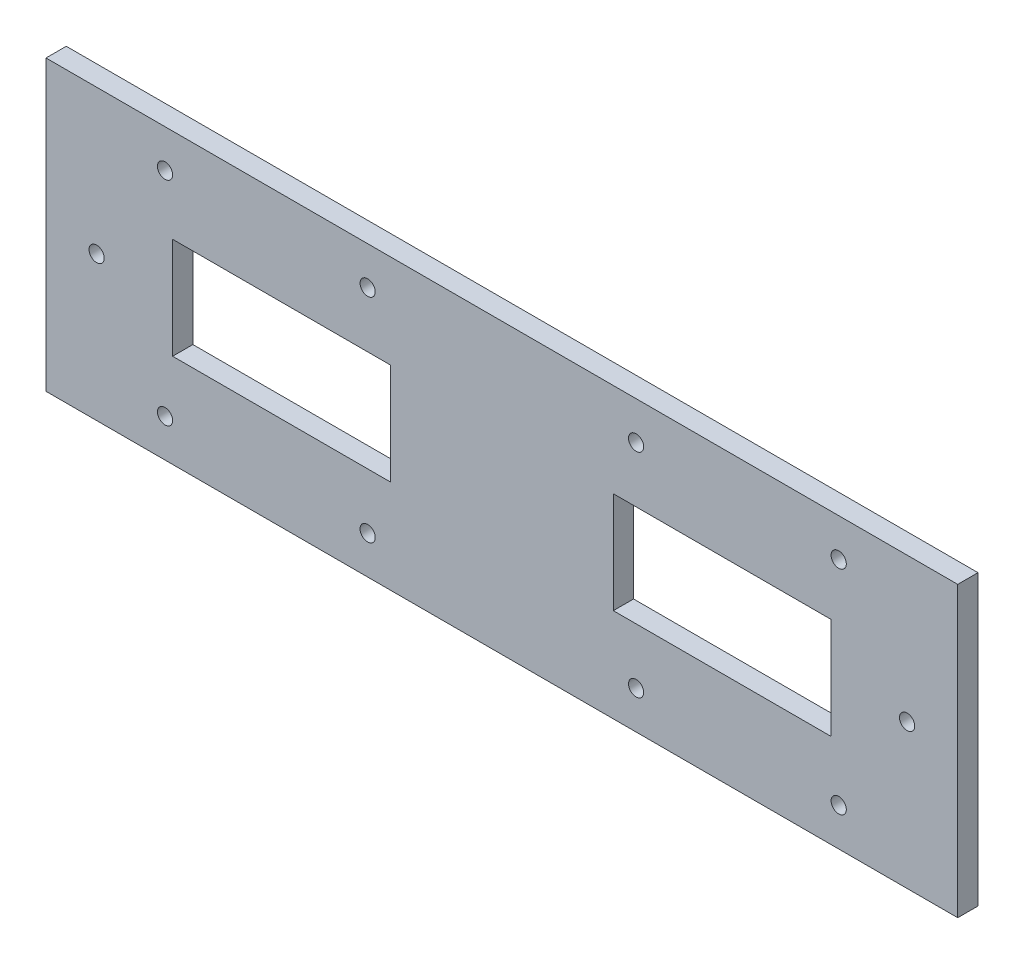
ISO-10303-21;
HEADER;
FILE_DESCRIPTION(('STEP AP214'),'2;1');
FILE_NAME('part.step','',(''),(''),'','','');
FILE_SCHEMA(('AUTOMOTIVE_DESIGN { 1 0 10303 214 1 1 1 1 }'));
ENDSEC;
DATA;
#1=APPLICATION_CONTEXT('core data for automotive mechanical design processes');
#2=APPLICATION_PROTOCOL_DEFINITION('international standard','automotive_design',2000,#1);
#3=PRODUCT_CONTEXT('',#1,'mechanical');
#4=PRODUCT('Part','Part','',(#3));
#5=PRODUCT_RELATED_PRODUCT_CATEGORY('part','',(#4));
#6=PRODUCT_DEFINITION_FORMATION('','',#4);
#7=PRODUCT_DEFINITION_CONTEXT('part definition',#1,'design');
#8=PRODUCT_DEFINITION('design','',#6,#7);
#9=PRODUCT_DEFINITION_SHAPE('','',#8);
#10=(LENGTH_UNIT() NAMED_UNIT(*) SI_UNIT(.MILLI.,.METRE.));
#11=(NAMED_UNIT(*) PLANE_ANGLE_UNIT() SI_UNIT($,.RADIAN.));
#12=(NAMED_UNIT(*) SI_UNIT($,.STERADIAN.) SOLID_ANGLE_UNIT());
#13=UNCERTAINTY_MEASURE_WITH_UNIT(LENGTH_MEASURE(1.E-05),#10,'distance_accuracy_value','');
#14=(GEOMETRIC_REPRESENTATION_CONTEXT(3) GLOBAL_UNCERTAINTY_ASSIGNED_CONTEXT((#13)) GLOBAL_UNIT_ASSIGNED_CONTEXT((#10,
#11,#12)) REPRESENTATION_CONTEXT('',''));
#15=CARTESIAN_POINT('',(0.,0.,0.));
#16=DIRECTION('',(0.,0.,1.));
#17=DIRECTION('',(1.,0.,0.));
#18=AXIS2_PLACEMENT_3D('',#15,#16,#17);
#19=CARTESIAN_POINT('',(0.,7.2232845894263,-4.));
#20=DIRECTION('',(0.,-1.,0.));
#21=DIRECTION('',(0.,0.,-1.));
#22=AXIS2_PLACEMENT_3D('',#19,#20,#21);
#23=PLANE('',#22);
#24=DIRECTION('',(1.,0.,0.));
#25=VECTOR('',#24,1.);
#26=CARTESIAN_POINT('',(0.,7.2232845894263,0.));
#27=LINE('',#26,#25);
#28=CARTESIAN_POINT('',(-46.5564090804862,7.2232845894263,0.));
#29=VERTEX_POINT('',#28);
#30=CARTESIAN_POINT('',(-3.55640908048613,7.2232845894263,0.));
#31=VERTEX_POINT('',#30);
#32=EDGE_CURVE('E210',#29,#31,#27,.T.);
#33=ORIENTED_EDGE('',*,*,#32,.F.);
#34=DIRECTION('',(0.,0.,1.));
#35=VECTOR('',#34,1.);
#36=CARTESIAN_POINT('',(-46.5564090804862,7.2232845894263,-4.));
#37=LINE('',#36,#35);
#38=CARTESIAN_POINT('',(-46.5564090804862,7.2232845894263,-4.));
#39=VERTEX_POINT('',#38);
#40=EDGE_CURVE('E11',#39,#29,#37,.T.);
#41=ORIENTED_EDGE('',*,*,#40,.F.);
#42=DIRECTION('',(1.,0.,0.));
#43=VECTOR('',#42,1.);
#44=CARTESIAN_POINT('',(0.,7.2232845894263,-4.));
#45=LINE('',#44,#43);
#46=CARTESIAN_POINT('',(-3.55640908048613,7.2232845894263,-4.));
#47=VERTEX_POINT('',#46);
#48=EDGE_CURVE('E150',#39,#47,#45,.T.);
#49=ORIENTED_EDGE('',*,*,#48,.T.);
#50=DIRECTION('',(0.,0.,1.));
#51=VECTOR('',#50,1.);
#52=CARTESIAN_POINT('',(-3.55640908048613,7.2232845894263,-4.));
#53=LINE('',#52,#51);
#54=EDGE_CURVE('E147',#47,#31,#53,.T.);
#55=ORIENTED_EDGE('',*,*,#54,.T.);
#56=EDGE_LOOP('',(#33,#41,#49,#55));
#57=FACE_BOUND('',#56,.T.);
#58=ADVANCED_FACE('F35',(#57),#23,.T.);
#59=CARTESIAN_POINT('',(-46.5564090804862,0.,-4.));
#60=DIRECTION('',(-1.,0.,0.));
#61=DIRECTION('',(0.,0.,1.));
#62=AXIS2_PLACEMENT_3D('',#59,#60,#61);
#63=PLANE('',#62);
#64=DIRECTION('',(0.,-1.,0.));
#65=VECTOR('',#64,1.);
#66=CARTESIAN_POINT('',(-46.5564090804862,0.,0.));
#67=LINE('',#66,#65);
#68=CARTESIAN_POINT('',(-46.5564090804862,-12.7767154105737,0.));
#69=VERTEX_POINT('',#68);
#70=EDGE_CURVE('E216',#29,#69,#67,.T.);
#71=ORIENTED_EDGE('',*,*,#70,.T.);
#72=DIRECTION('',(0.,0.,1.));
#73=VECTOR('',#72,1.);
#74=CARTESIAN_POINT('',(-46.5564090804862,-12.7767154105737,-4.));
#75=LINE('',#74,#73);
#76=CARTESIAN_POINT('',(-46.5564090804862,-12.7767154105737,-4.));
#77=VERTEX_POINT('',#76);
#78=EDGE_CURVE('E45',#77,#69,#75,.T.);
#79=ORIENTED_EDGE('',*,*,#78,.F.);
#80=DIRECTION('',(0.,-1.,0.));
#81=VECTOR('',#80,1.);
#82=CARTESIAN_POINT('',(-46.5564090804862,0.,-4.));
#83=LINE('',#82,#81);
#84=EDGE_CURVE('E139',#39,#77,#83,.T.);
#85=ORIENTED_EDGE('',*,*,#84,.F.);
#86=ORIENTED_EDGE('',*,*,#40,.T.);
#87=EDGE_LOOP('',(#71,#79,#85,#86));
#88=FACE_BOUND('',#87,.T.);
#89=ADVANCED_FACE('F264',(#88),#63,.F.);
#90=CARTESIAN_POINT('',(0.,-12.7767154105737,-4.));
#91=DIRECTION('',(0.,-1.,0.));
#92=DIRECTION('',(1.,0.,0.));
#93=AXIS2_PLACEMENT_3D('',#90,#91,#92);
#94=PLANE('',#93);
#95=DIRECTION('',(1.,0.,0.));
#96=VECTOR('',#95,1.);
#97=CARTESIAN_POINT('',(0.,-12.7767154105737,0.));
#98=LINE('',#97,#96);
#99=CARTESIAN_POINT('',(-3.55640908048612,-12.7767154105737,0.));
#100=VERTEX_POINT('',#99);
#101=EDGE_CURVE('E94',#69,#100,#98,.T.);
#102=ORIENTED_EDGE('',*,*,#101,.T.);
#103=DIRECTION('',(0.,0.,1.));
#104=VECTOR('',#103,1.);
#105=CARTESIAN_POINT('',(-3.55640908048612,-12.7767154105737,-4.));
#106=LINE('',#105,#104);
#107=CARTESIAN_POINT('',(-3.55640908048612,-12.7767154105737,-4.));
#108=VERTEX_POINT('',#107);
#109=EDGE_CURVE('E143',#108,#100,#106,.T.);
#110=ORIENTED_EDGE('',*,*,#109,.F.);
#111=DIRECTION('',(1.,0.,0.));
#112=VECTOR('',#111,1.);
#113=CARTESIAN_POINT('',(0.,-12.7767154105737,-4.));
#114=LINE('',#113,#112);
#115=EDGE_CURVE('E133',#77,#108,#114,.T.);
#116=ORIENTED_EDGE('',*,*,#115,.F.);
#117=ORIENTED_EDGE('',*,*,#78,.T.);
#118=EDGE_LOOP('',(#102,#110,#116,#117));
#119=FACE_BOUND('',#118,.T.);
#120=ADVANCED_FACE('F144',(#119),#94,.F.);
#121=CARTESIAN_POINT('',(108.443590919514,0.,-4.));
#122=DIRECTION('',(-1.,0.,0.));
#123=DIRECTION('',(0.,-1.,0.));
#124=AXIS2_PLACEMENT_3D('',#121,#122,#123);
#125=PLANE('',#124);
#126=DIRECTION('',(0.,-1.,0.));
#127=VECTOR('',#126,1.);
#128=CARTESIAN_POINT('',(108.443590919514,0.,0.));
#129=LINE('',#128,#127);
#130=CARTESIAN_POINT('',(108.443590919514,25.7232845894263,0.));
#131=VERTEX_POINT('',#130);
#132=CARTESIAN_POINT('',(108.443590919514,-31.2767154105737,0.));
#133=VERTEX_POINT('',#132);
#134=EDGE_CURVE('E199',#131,#133,#129,.T.);
#135=ORIENTED_EDGE('',*,*,#134,.T.);
#136=DIRECTION('',(0.,0.,1.));
#137=VECTOR('',#136,1.);
#138=CARTESIAN_POINT('',(108.443590919514,-31.2767154105737,-4.));
#139=LINE('',#138,#137);
#140=CARTESIAN_POINT('',(108.443590919514,-31.2767154105737,-4.));
#141=VERTEX_POINT('',#140);
#142=EDGE_CURVE('E221',#141,#133,#139,.T.);
#143=ORIENTED_EDGE('',*,*,#142,.F.);
#144=DIRECTION('',(0.,-1.,0.));
#145=VECTOR('',#144,1.);
#146=CARTESIAN_POINT('',(108.443590919514,0.,-4.));
#147=LINE('',#146,#145);
#148=CARTESIAN_POINT('',(108.443590919514,25.7232845894263,-4.));
#149=VERTEX_POINT('',#148);
#150=EDGE_CURVE('E298',#149,#141,#147,.T.);
#151=ORIENTED_EDGE('',*,*,#150,.F.);
#152=DIRECTION('',(0.,0.,1.));
#153=VECTOR('',#152,1.);
#154=CARTESIAN_POINT('',(108.443590919514,25.7232845894263,-4.));
#155=LINE('',#154,#153);
#156=EDGE_CURVE('E227',#149,#131,#155,.T.);
#157=ORIENTED_EDGE('',*,*,#156,.T.);
#158=EDGE_LOOP('',(#135,#143,#151,#157));
#159=FACE_BOUND('',#158,.T.);
#160=ADVANCED_FACE('F277',(#159),#125,.F.);
#161=CARTESIAN_POINT('',(0.,-31.2767154105737,-4.));
#162=DIRECTION('',(0.,-1.,0.));
#163=DIRECTION('',(1.,0.,0.));
#164=AXIS2_PLACEMENT_3D('',#161,#162,#163);
#165=PLANE('',#164);
#166=DIRECTION('',(1.,0.,0.));
#167=VECTOR('',#166,1.);
#168=CARTESIAN_POINT('',(0.,-31.2767154105737,0.));
#169=LINE('',#168,#167);
#170=CARTESIAN_POINT('',(-71.5564090804862,-31.2767154105737,0.));
#171=VERTEX_POINT('',#170);
#172=EDGE_CURVE('E207',#171,#133,#169,.T.);
#173=ORIENTED_EDGE('',*,*,#172,.F.);
#174=DIRECTION('',(0.,0.,1.));
#175=VECTOR('',#174,1.);
#176=CARTESIAN_POINT('',(-71.5564090804862,-31.2767154105737,-4.));
#177=LINE('',#176,#175);
#178=CARTESIAN_POINT('',(-71.5564090804862,-31.2767154105737,-4.));
#179=VERTEX_POINT('',#178);
#180=EDGE_CURVE('E223',#179,#171,#177,.T.);
#181=ORIENTED_EDGE('',*,*,#180,.F.);
#182=DIRECTION('',(1.,0.,0.));
#183=VECTOR('',#182,1.);
#184=CARTESIAN_POINT('',(0.,-31.2767154105737,-4.));
#185=LINE('',#184,#183);
#186=EDGE_CURVE('E152',#179,#141,#185,.T.);
#187=ORIENTED_EDGE('',*,*,#186,.T.);
#188=ORIENTED_EDGE('',*,*,#142,.T.);
#189=EDGE_LOOP('',(#173,#181,#187,#188));
#190=FACE_BOUND('',#189,.T.);
#191=ADVANCED_FACE('F273',(#190),#165,.T.);
#192=CARTESIAN_POINT('',(-71.5564090804862,0.,-4.));
#193=DIRECTION('',(-1.,0.,0.));
#194=DIRECTION('',(0.,0.,1.));
#195=AXIS2_PLACEMENT_3D('',#192,#193,#194);
#196=PLANE('',#195);
#197=DIRECTION('',(0.,-1.,0.));
#198=VECTOR('',#197,1.);
#199=CARTESIAN_POINT('',(-71.5564090804862,0.,0.));
#200=LINE('',#199,#198);
#201=CARTESIAN_POINT('',(-71.5564090804862,25.7232845894263,0.));
#202=VERTEX_POINT('',#201);
#203=EDGE_CURVE('E204',#202,#171,#200,.T.);
#204=ORIENTED_EDGE('',*,*,#203,.F.);
#205=DIRECTION('',(0.,0.,1.));
#206=VECTOR('',#205,1.);
#207=CARTESIAN_POINT('',(-71.5564090804862,25.7232845894263,-4.));
#208=LINE('',#207,#206);
#209=CARTESIAN_POINT('',(-71.5564090804862,25.7232845894263,-4.));
#210=VERTEX_POINT('',#209);
#211=EDGE_CURVE('E225',#210,#202,#208,.T.);
#212=ORIENTED_EDGE('',*,*,#211,.F.);
#213=DIRECTION('',(0.,-1.,0.));
#214=VECTOR('',#213,1.);
#215=CARTESIAN_POINT('',(-71.5564090804862,0.,-4.));
#216=LINE('',#215,#214);
#217=EDGE_CURVE('E314',#210,#179,#216,.T.);
#218=ORIENTED_EDGE('',*,*,#217,.T.);
#219=ORIENTED_EDGE('',*,*,#180,.T.);
#220=EDGE_LOOP('',(#204,#212,#218,#219));
#221=FACE_BOUND('',#220,.T.);
#222=ADVANCED_FACE('F276',(#221),#196,.T.);
#223=CARTESIAN_POINT('',(40.4435909195139,0.,-4.));
#224=DIRECTION('',(-1.,0.,0.));
#225=DIRECTION('',(0.,0.,1.));
#226=AXIS2_PLACEMENT_3D('',#223,#224,#225);
#227=PLANE('',#226);
#228=DIRECTION('',(0.,-1.,0.));
#229=VECTOR('',#228,1.);
#230=CARTESIAN_POINT('',(40.4435909195139,0.,0.));
#231=LINE('',#230,#229);
#232=CARTESIAN_POINT('',(40.4435909195139,7.2232845894263,0.));
#233=VERTEX_POINT('',#232);
#234=CARTESIAN_POINT('',(40.4435909195139,-12.7767154105737,0.));
#235=VERTEX_POINT('',#234);
#236=EDGE_CURVE('E187',#233,#235,#231,.T.);
#237=ORIENTED_EDGE('',*,*,#236,.T.);
#238=DIRECTION('',(0.,0.,1.));
#239=VECTOR('',#238,1.);
#240=CARTESIAN_POINT('',(40.4435909195139,-12.7767154105737,-4.));
#241=LINE('',#240,#239);
#242=CARTESIAN_POINT('',(40.4435909195139,-12.7767154105737,-4.));
#243=VERTEX_POINT('',#242);
#244=EDGE_CURVE('E230',#243,#235,#241,.T.);
#245=ORIENTED_EDGE('',*,*,#244,.F.);
#246=DIRECTION('',(0.,-1.,0.));
#247=VECTOR('',#246,1.);
#248=CARTESIAN_POINT('',(40.4435909195139,0.,-4.));
#249=LINE('',#248,#247);
#250=CARTESIAN_POINT('',(40.4435909195139,7.2232845894263,-4.));
#251=VERTEX_POINT('',#250);
#252=EDGE_CURVE('E241',#251,#243,#249,.T.);
#253=ORIENTED_EDGE('',*,*,#252,.F.);
#254=DIRECTION('',(0.,0.,1.));
#255=VECTOR('',#254,1.);
#256=CARTESIAN_POINT('',(40.4435909195139,7.2232845894263,-4.));
#257=LINE('',#256,#255);
#258=EDGE_CURVE('E39',#251,#233,#257,.T.);
#259=ORIENTED_EDGE('',*,*,#258,.T.);
#260=EDGE_LOOP('',(#237,#245,#253,#259));
#261=FACE_BOUND('',#260,.T.);
#262=ADVANCED_FACE('F238',(#261),#227,.F.);
#263=CARTESIAN_POINT('',(0.,-12.7767154105737,-4.));
#264=DIRECTION('',(0.,-1.,0.));
#265=DIRECTION('',(1.,0.,0.));
#266=AXIS2_PLACEMENT_3D('',#263,#264,#265);
#267=PLANE('',#266);
#268=DIRECTION('',(1.,0.,0.));
#269=VECTOR('',#268,1.);
#270=CARTESIAN_POINT('',(0.,-12.7767154105737,0.));
#271=LINE('',#270,#269);
#272=CARTESIAN_POINT('',(83.4435909195139,-12.7767154105737,0.));
#273=VERTEX_POINT('',#272);
#274=EDGE_CURVE('E196',#235,#273,#271,.T.);
#275=ORIENTED_EDGE('',*,*,#274,.T.);
#276=DIRECTION('',(0.,0.,1.));
#277=VECTOR('',#276,1.);
#278=CARTESIAN_POINT('',(83.4435909195139,-12.7767154105737,-4.));
#279=LINE('',#278,#277);
#280=CARTESIAN_POINT('',(83.4435909195139,-12.7767154105737,-4.));
#281=VERTEX_POINT('',#280);
#282=EDGE_CURVE('E233',#281,#273,#279,.T.);
#283=ORIENTED_EDGE('',*,*,#282,.F.);
#284=DIRECTION('',(1.,0.,0.));
#285=VECTOR('',#284,1.);
#286=CARTESIAN_POINT('',(0.,-12.7767154105737,-4.));
#287=LINE('',#286,#285);
#288=EDGE_CURVE('E296',#243,#281,#287,.T.);
#289=ORIENTED_EDGE('',*,*,#288,.F.);
#290=ORIENTED_EDGE('',*,*,#244,.T.);
#291=EDGE_LOOP('',(#275,#283,#289,#290));
#292=FACE_BOUND('',#291,.T.);
#293=ADVANCED_FACE('F285',(#292),#267,.F.);
#294=CARTESIAN_POINT('',(83.4435909195139,0.,-4.));
#295=DIRECTION('',(-1.,0.,0.));
#296=DIRECTION('',(0.,0.,1.));
#297=AXIS2_PLACEMENT_3D('',#294,#295,#296);
#298=PLANE('',#297);
#299=DIRECTION('',(0.,-1.,0.));
#300=VECTOR('',#299,1.);
#301=CARTESIAN_POINT('',(83.4435909195139,0.,0.));
#302=LINE('',#301,#300);
#303=CARTESIAN_POINT('',(83.4435909195139,7.2232845894263,0.));
#304=VERTEX_POINT('',#303);
#305=EDGE_CURVE('E193',#304,#273,#302,.T.);
#306=ORIENTED_EDGE('',*,*,#305,.F.);
#307=DIRECTION('',(0.,0.,1.));
#308=VECTOR('',#307,1.);
#309=CARTESIAN_POINT('',(83.4435909195139,7.2232845894263,-4.));
#310=LINE('',#309,#308);
#311=CARTESIAN_POINT('',(83.4435909195139,7.2232845894263,-4.));
#312=VERTEX_POINT('',#311);
#313=EDGE_CURVE('E234',#312,#304,#310,.T.);
#314=ORIENTED_EDGE('',*,*,#313,.F.);
#315=DIRECTION('',(0.,-1.,0.));
#316=VECTOR('',#315,1.);
#317=CARTESIAN_POINT('',(83.4435909195139,0.,-4.));
#318=LINE('',#317,#316);
#319=EDGE_CURVE('E295',#312,#281,#318,.T.);
#320=ORIENTED_EDGE('',*,*,#319,.T.);
#321=ORIENTED_EDGE('',*,*,#282,.T.);
#322=EDGE_LOOP('',(#306,#314,#320,#321));
#323=FACE_BOUND('',#322,.T.);
#324=ADVANCED_FACE('F258',(#323),#298,.T.);
#325=CARTESIAN_POINT('',(0.,25.7232845894263,-4.));
#326=DIRECTION('',(0.,-1.,0.));
#327=DIRECTION('',(1.,0.,0.));
#328=AXIS2_PLACEMENT_3D('',#325,#326,#327);
#329=PLANE('',#328);
#330=DIRECTION('',(1.,0.,0.));
#331=VECTOR('',#330,1.);
#332=CARTESIAN_POINT('',(0.,25.7232845894263,0.));
#333=LINE('',#332,#331);
#334=EDGE_CURVE('E202',#202,#131,#333,.T.);
#335=ORIENTED_EDGE('',*,*,#334,.T.);
#336=ORIENTED_EDGE('',*,*,#156,.F.);
#337=DIRECTION('',(1.,0.,0.));
#338=VECTOR('',#337,1.);
#339=CARTESIAN_POINT('',(0.,25.7232845894263,-4.));
#340=LINE('',#339,#338);
#341=EDGE_CURVE('E312',#210,#149,#340,.T.);
#342=ORIENTED_EDGE('',*,*,#341,.F.);
#343=ORIENTED_EDGE('',*,*,#211,.T.);
#344=EDGE_LOOP('',(#335,#336,#342,#343));
#345=FACE_BOUND('',#344,.T.);
#346=ADVANCED_FACE('F249',(#345),#329,.F.);
#347=CARTESIAN_POINT('',(0.,7.2232845894263,-4.));
#348=DIRECTION('',(0.,-1.,0.));
#349=DIRECTION('',(0.,0.,-1.));
#350=AXIS2_PLACEMENT_3D('',#347,#348,#349);
#351=PLANE('',#350);
#352=DIRECTION('',(1.,0.,0.));
#353=VECTOR('',#352,1.);
#354=CARTESIAN_POINT('',(0.,7.2232845894263,0.));
#355=LINE('',#354,#353);
#356=EDGE_CURVE('E190',#233,#304,#355,.T.);
#357=ORIENTED_EDGE('',*,*,#356,.F.);
#358=ORIENTED_EDGE('',*,*,#258,.F.);
#359=DIRECTION('',(1.,0.,0.));
#360=VECTOR('',#359,1.);
#361=CARTESIAN_POINT('',(0.,7.2232845894263,-4.));
#362=LINE('',#361,#360);
#363=EDGE_CURVE('E301',#251,#312,#362,.T.);
#364=ORIENTED_EDGE('',*,*,#363,.T.);
#365=ORIENTED_EDGE('',*,*,#313,.T.);
#366=EDGE_LOOP('',(#357,#358,#364,#365));
#367=FACE_BOUND('',#366,.T.);
#368=ADVANCED_FACE('F246',(#367),#351,.T.);
#369=CARTESIAN_POINT('',(-48.0564090804862,18.2232845894263,-4.));
#370=DIRECTION('',(0.,0.,1.));
#371=DIRECTION('',(1.,0.,0.));
#372=AXIS2_PLACEMENT_3D('',#369,#370,#371);
#373=CYLINDRICAL_SURFACE('',#372,1.5);
#374=CARTESIAN_POINT('',(-48.0564090804862,18.2232845894263,-4.));
#375=DIRECTION('',(0.,0.,1.));
#376=DIRECTION('',(1.,0.,0.));
#377=AXIS2_PLACEMENT_3D('',#374,#375,#376);
#378=CIRCLE('',#377,1.5);
#379=CARTESIAN_POINT('',(-46.5564090804862,18.2232845894263,-4.));
#380=VERTEX_POINT('',#379);
#381=EDGE_CURVE('E302',#380,#380,#378,.T.);
#382=ORIENTED_EDGE('',*,*,#381,.F.);
#383=EDGE_LOOP('',(#382));
#384=FACE_BOUND('',#383,.T.);
#385=CARTESIAN_POINT('',(-48.0564090804862,18.2232845894263,0.));
#386=DIRECTION('',(0.,0.,1.));
#387=DIRECTION('',(1.,0.,0.));
#388=AXIS2_PLACEMENT_3D('',#385,#386,#387);
#389=CIRCLE('',#388,1.5);
#390=CARTESIAN_POINT('',(-46.5564090804862,18.2232845894263,0.));
#391=VERTEX_POINT('',#390);
#392=EDGE_CURVE('E184',#391,#391,#389,.T.);
#393=ORIENTED_EDGE('',*,*,#392,.T.);
#394=EDGE_LOOP('',(#393));
#395=FACE_BOUND('',#394,.T.);
#396=ADVANCED_FACE('F248',(#384,#395),#373,.F.);
#397=CARTESIAN_POINT('',(-8.05640908048616,18.2232845894263,-4.));
#398=DIRECTION('',(0.,0.,1.));
#399=DIRECTION('',(1.,0.,0.));
#400=AXIS2_PLACEMENT_3D('',#397,#398,#399);
#401=CYLINDRICAL_SURFACE('',#400,1.5);
#402=CARTESIAN_POINT('',(-8.05640908048616,18.2232845894263,-4.));
#403=DIRECTION('',(0.,0.,1.));
#404=DIRECTION('',(1.,0.,0.));
#405=AXIS2_PLACEMENT_3D('',#402,#403,#404);
#406=CIRCLE('',#405,1.5);
#407=CARTESIAN_POINT('',(-6.55640908048616,18.2232845894263,-4.));
#408=VERTEX_POINT('',#407);
#409=EDGE_CURVE('E306',#408,#408,#406,.T.);
#410=ORIENTED_EDGE('',*,*,#409,.F.);
#411=EDGE_LOOP('',(#410));
#412=FACE_BOUND('',#411,.T.);
#413=CARTESIAN_POINT('',(-8.05640908048616,18.2232845894263,0.));
#414=DIRECTION('',(0.,0.,1.));
#415=DIRECTION('',(1.,0.,0.));
#416=AXIS2_PLACEMENT_3D('',#413,#414,#415);
#417=CIRCLE('',#416,1.5);
#418=CARTESIAN_POINT('',(-6.55640908048616,18.2232845894263,0.));
#419=VERTEX_POINT('',#418);
#420=EDGE_CURVE('E181',#419,#419,#417,.T.);
#421=ORIENTED_EDGE('',*,*,#420,.T.);
#422=EDGE_LOOP('',(#421));
#423=FACE_BOUND('',#422,.T.);
#424=ADVANCED_FACE('F255',(#412,#423),#401,.F.);
#425=CARTESIAN_POINT('',(44.9435909195138,18.2232845894263,-4.));
#426=DIRECTION('',(0.,0.,1.));
#427=DIRECTION('',(1.,0.,0.));
#428=AXIS2_PLACEMENT_3D('',#425,#426,#427);
#429=CYLINDRICAL_SURFACE('',#428,1.5);
#430=CARTESIAN_POINT('',(44.9435909195138,18.2232845894263,-4.));
#431=DIRECTION('',(0.,0.,1.));
#432=DIRECTION('',(1.,0.,0.));
#433=AXIS2_PLACEMENT_3D('',#430,#431,#432);
#434=CIRCLE('',#433,1.5);
#435=CARTESIAN_POINT('',(46.4435909195138,18.2232845894263,-4.));
#436=VERTEX_POINT('',#435);
#437=EDGE_CURVE('E514',#436,#436,#434,.T.);
#438=ORIENTED_EDGE('',*,*,#437,.F.);
#439=EDGE_LOOP('',(#438));
#440=FACE_BOUND('',#439,.T.);
#441=CARTESIAN_POINT('',(44.9435909195138,18.2232845894263,0.));
#442=DIRECTION('',(0.,0.,1.));
#443=DIRECTION('',(1.,0.,0.));
#444=AXIS2_PLACEMENT_3D('',#441,#442,#443);
#445=CIRCLE('',#444,1.5);
#446=CARTESIAN_POINT('',(46.4435909195138,18.2232845894263,0.));
#447=VERTEX_POINT('',#446);
#448=EDGE_CURVE('E178',#447,#447,#445,.T.);
#449=ORIENTED_EDGE('',*,*,#448,.T.);
#450=EDGE_LOOP('',(#449));
#451=FACE_BOUND('',#450,.T.);
#452=ADVANCED_FACE('F393',(#440,#451),#429,.F.);
#453=CARTESIAN_POINT('',(84.9435909195138,18.2232845894263,-4.));
#454=DIRECTION('',(0.,0.,1.));
#455=DIRECTION('',(1.,0.,0.));
#456=AXIS2_PLACEMENT_3D('',#453,#454,#455);
#457=CYLINDRICAL_SURFACE('',#456,1.50000000000001);
#458=CARTESIAN_POINT('',(84.9435909195138,18.2232845894263,-4.));
#459=DIRECTION('',(0.,0.,1.));
#460=DIRECTION('',(1.,0.,0.));
#461=AXIS2_PLACEMENT_3D('',#458,#459,#460);
#462=CIRCLE('',#461,1.50000000000001);
#463=CARTESIAN_POINT('',(86.4435909195139,18.2232845894263,-4.));
#464=VERTEX_POINT('',#463);
#465=EDGE_CURVE('E511',#464,#464,#462,.T.);
#466=ORIENTED_EDGE('',*,*,#465,.F.);
#467=EDGE_LOOP('',(#466));
#468=FACE_BOUND('',#467,.T.);
#469=CARTESIAN_POINT('',(84.9435909195138,18.2232845894263,0.));
#470=DIRECTION('',(0.,0.,1.));
#471=DIRECTION('',(1.,0.,0.));
#472=AXIS2_PLACEMENT_3D('',#469,#470,#471);
#473=CIRCLE('',#472,1.50000000000001);
#474=CARTESIAN_POINT('',(86.4435909195139,18.2232845894263,0.));
#475=VERTEX_POINT('',#474);
#476=EDGE_CURVE('E175',#475,#475,#473,.T.);
#477=ORIENTED_EDGE('',*,*,#476,.T.);
#478=EDGE_LOOP('',(#477));
#479=FACE_BOUND('',#478,.T.);
#480=ADVANCED_FACE('F403',(#468,#479),#457,.F.);
#481=CARTESIAN_POINT('',(44.9435909195143,-23.7767154105737,-4.));
#482=DIRECTION('',(0.,0.,1.));
#483=DIRECTION('',(1.,0.,0.));
#484=AXIS2_PLACEMENT_3D('',#481,#482,#483);
#485=CYLINDRICAL_SURFACE('',#484,1.5);
#486=CARTESIAN_POINT('',(44.9435909195143,-23.7767154105737,-4.));
#487=DIRECTION('',(0.,0.,1.));
#488=DIRECTION('',(1.,0.,0.));
#489=AXIS2_PLACEMENT_3D('',#486,#487,#488);
#490=CIRCLE('',#489,1.5);
#491=CARTESIAN_POINT('',(46.4435909195143,-23.7767154105737,-4.));
#492=VERTEX_POINT('',#491);
#493=EDGE_CURVE('E508',#492,#492,#490,.T.);
#494=ORIENTED_EDGE('',*,*,#493,.F.);
#495=EDGE_LOOP('',(#494));
#496=FACE_BOUND('',#495,.T.);
#497=CARTESIAN_POINT('',(44.9435909195143,-23.7767154105737,0.));
#498=DIRECTION('',(0.,0.,1.));
#499=DIRECTION('',(1.,0.,0.));
#500=AXIS2_PLACEMENT_3D('',#497,#498,#499);
#501=CIRCLE('',#500,1.5);
#502=CARTESIAN_POINT('',(46.4435909195143,-23.7767154105737,0.));
#503=VERTEX_POINT('',#502);
#504=EDGE_CURVE('E172',#503,#503,#501,.T.);
#505=ORIENTED_EDGE('',*,*,#504,.T.);
#506=EDGE_LOOP('',(#505));
#507=FACE_BOUND('',#506,.T.);
#508=ADVANCED_FACE('F413',(#496,#507),#485,.F.);
#509=CARTESIAN_POINT('',(84.9435909195143,-23.7767154105737,-4.));
#510=DIRECTION('',(0.,0.,1.));
#511=DIRECTION('',(1.,0.,0.));
#512=AXIS2_PLACEMENT_3D('',#509,#510,#511);
#513=CYLINDRICAL_SURFACE('',#512,1.50000000000001);
#514=CARTESIAN_POINT('',(84.9435909195143,-23.7767154105737,-4.));
#515=DIRECTION('',(0.,0.,1.));
#516=DIRECTION('',(1.,0.,0.));
#517=AXIS2_PLACEMENT_3D('',#514,#515,#516);
#518=CIRCLE('',#517,1.50000000000001);
#519=CARTESIAN_POINT('',(86.4435909195143,-23.7767154105737,-4.));
#520=VERTEX_POINT('',#519);
#521=EDGE_CURVE('E505',#520,#520,#518,.T.);
#522=ORIENTED_EDGE('',*,*,#521,.F.);
#523=EDGE_LOOP('',(#522));
#524=FACE_BOUND('',#523,.T.);
#525=CARTESIAN_POINT('',(84.9435909195143,-23.7767154105737,0.));
#526=DIRECTION('',(0.,0.,1.));
#527=DIRECTION('',(1.,0.,0.));
#528=AXIS2_PLACEMENT_3D('',#525,#526,#527);
#529=CIRCLE('',#528,1.50000000000001);
#530=CARTESIAN_POINT('',(86.4435909195143,-23.7767154105737,0.));
#531=VERTEX_POINT('',#530);
#532=EDGE_CURVE('E169',#531,#531,#529,.T.);
#533=ORIENTED_EDGE('',*,*,#532,.T.);
#534=EDGE_LOOP('',(#533));
#535=FACE_BOUND('',#534,.T.);
#536=ADVANCED_FACE('F423',(#524,#535),#513,.F.);
#537=CARTESIAN_POINT('',(-48.0564090804857,-23.7767154105737,-4.));
#538=DIRECTION('',(0.,0.,1.));
#539=DIRECTION('',(1.,0.,0.));
#540=AXIS2_PLACEMENT_3D('',#537,#538,#539);
#541=CYLINDRICAL_SURFACE('',#540,1.5);
#542=CARTESIAN_POINT('',(-48.0564090804857,-23.7767154105737,-4.));
#543=DIRECTION('',(0.,0.,1.));
#544=DIRECTION('',(1.,0.,0.));
#545=AXIS2_PLACEMENT_3D('',#542,#543,#544);
#546=CIRCLE('',#545,1.5);
#547=CARTESIAN_POINT('',(-46.5564090804857,-23.7767154105737,-4.));
#548=VERTEX_POINT('',#547);
#549=EDGE_CURVE('E502',#548,#548,#546,.T.);
#550=ORIENTED_EDGE('',*,*,#549,.F.);
#551=EDGE_LOOP('',(#550));
#552=FACE_BOUND('',#551,.T.);
#553=CARTESIAN_POINT('',(-48.0564090804857,-23.7767154105737,0.));
#554=DIRECTION('',(0.,0.,1.));
#555=DIRECTION('',(1.,0.,0.));
#556=AXIS2_PLACEMENT_3D('',#553,#554,#555);
#557=CIRCLE('',#556,1.5);
#558=CARTESIAN_POINT('',(-46.5564090804857,-23.7767154105737,0.));
#559=VERTEX_POINT('',#558);
#560=EDGE_CURVE('E166',#559,#559,#557,.T.);
#561=ORIENTED_EDGE('',*,*,#560,.T.);
#562=EDGE_LOOP('',(#561));
#563=FACE_BOUND('',#562,.T.);
#564=ADVANCED_FACE('F433',(#552,#563),#541,.F.);
#565=CARTESIAN_POINT('',(-8.05640908048572,-23.7767154105737,-4.));
#566=DIRECTION('',(0.,0.,1.));
#567=DIRECTION('',(1.,0.,0.));
#568=AXIS2_PLACEMENT_3D('',#565,#566,#567);
#569=CYLINDRICAL_SURFACE('',#568,1.5);
#570=CARTESIAN_POINT('',(-8.05640908048572,-23.7767154105737,-4.));
#571=DIRECTION('',(0.,0.,1.));
#572=DIRECTION('',(1.,0.,0.));
#573=AXIS2_PLACEMENT_3D('',#570,#571,#572);
#574=CIRCLE('',#573,1.5);
#575=CARTESIAN_POINT('',(-6.55640908048571,-23.7767154105737,-4.));
#576=VERTEX_POINT('',#575);
#577=EDGE_CURVE('E497',#576,#576,#574,.T.);
#578=ORIENTED_EDGE('',*,*,#577,.F.);
#579=EDGE_LOOP('',(#578));
#580=FACE_BOUND('',#579,.T.);
#581=CARTESIAN_POINT('',(-8.05640908048572,-23.7767154105737,0.));
#582=DIRECTION('',(0.,0.,1.));
#583=DIRECTION('',(1.,0.,0.));
#584=AXIS2_PLACEMENT_3D('',#581,#582,#583);
#585=CIRCLE('',#584,1.5);
#586=CARTESIAN_POINT('',(-6.55640908048571,-23.7767154105737,0.));
#587=VERTEX_POINT('',#586);
#588=EDGE_CURVE('E163',#587,#587,#585,.T.);
#589=ORIENTED_EDGE('',*,*,#588,.T.);
#590=EDGE_LOOP('',(#589));
#591=FACE_BOUND('',#590,.T.);
#592=ADVANCED_FACE('F443',(#580,#591),#569,.F.);
#593=CARTESIAN_POINT('',(-61.5564090804862,-2.7767154105737,-4.));
#594=DIRECTION('',(0.,0.,1.));
#595=DIRECTION('',(1.,0.,0.));
#596=AXIS2_PLACEMENT_3D('',#593,#594,#595);
#597=CYLINDRICAL_SURFACE('',#596,1.5);
#598=CARTESIAN_POINT('',(-61.5564090804862,-2.7767154105737,-4.));
#599=DIRECTION('',(0.,0.,1.));
#600=DIRECTION('',(1.,0.,0.));
#601=AXIS2_PLACEMENT_3D('',#598,#599,#600);
#602=CIRCLE('',#601,1.5);
#603=CARTESIAN_POINT('',(-60.0564090804862,-2.7767154105737,-4.));
#604=VERTEX_POINT('',#603);
#605=EDGE_CURVE('E494',#604,#604,#602,.T.);
#606=ORIENTED_EDGE('',*,*,#605,.F.);
#607=EDGE_LOOP('',(#606));
#608=FACE_BOUND('',#607,.T.);
#609=CARTESIAN_POINT('',(-61.5564090804862,-2.7767154105737,0.));
#610=DIRECTION('',(0.,0.,1.));
#611=DIRECTION('',(1.,0.,0.));
#612=AXIS2_PLACEMENT_3D('',#609,#610,#611);
#613=CIRCLE('',#612,1.5);
#614=CARTESIAN_POINT('',(-60.0564090804862,-2.7767154105737,0.));
#615=VERTEX_POINT('',#614);
#616=EDGE_CURVE('E160',#615,#615,#613,.T.);
#617=ORIENTED_EDGE('',*,*,#616,.T.);
#618=EDGE_LOOP('',(#617));
#619=FACE_BOUND('',#618,.T.);
#620=ADVANCED_FACE('F453',(#608,#619),#597,.F.);
#621=CARTESIAN_POINT('',(98.4435909195139,-2.7767154105737,-4.));
#622=DIRECTION('',(0.,0.,1.));
#623=DIRECTION('',(1.,0.,0.));
#624=AXIS2_PLACEMENT_3D('',#621,#622,#623);
#625=CYLINDRICAL_SURFACE('',#624,1.5);
#626=CARTESIAN_POINT('',(98.4435909195139,-2.7767154105737,-4.));
#627=DIRECTION('',(0.,0.,1.));
#628=DIRECTION('',(1.,0.,0.));
#629=AXIS2_PLACEMENT_3D('',#626,#627,#628);
#630=CIRCLE('',#629,1.5);
#631=CARTESIAN_POINT('',(99.9435909195139,-2.7767154105737,-4.));
#632=VERTEX_POINT('',#631);
#633=EDGE_CURVE('E217',#632,#632,#630,.T.);
#634=ORIENTED_EDGE('',*,*,#633,.F.);
#635=EDGE_LOOP('',(#634));
#636=FACE_BOUND('',#635,.T.);
#637=CARTESIAN_POINT('',(98.4435909195139,-2.7767154105737,0.));
#638=DIRECTION('',(0.,0.,1.));
#639=DIRECTION('',(1.,0.,0.));
#640=AXIS2_PLACEMENT_3D('',#637,#638,#639);
#641=CIRCLE('',#640,1.5);
#642=CARTESIAN_POINT('',(99.9435909195139,-2.7767154105737,0.));
#643=VERTEX_POINT('',#642);
#644=EDGE_CURVE('E157',#643,#643,#641,.T.);
#645=ORIENTED_EDGE('',*,*,#644,.T.);
#646=EDGE_LOOP('',(#645));
#647=FACE_BOUND('',#646,.T.);
#648=ADVANCED_FACE('F37',(#636,#647),#625,.F.);
#649=CARTESIAN_POINT('',(-3.55640908048613,0.,-4.));
#650=DIRECTION('',(-1.,0.,0.));
#651=DIRECTION('',(0.,-1.,0.));
#652=AXIS2_PLACEMENT_3D('',#649,#650,#651);
#653=PLANE('',#652);
#654=DIRECTION('',(0.,-1.,0.));
#655=VECTOR('',#654,1.);
#656=CARTESIAN_POINT('',(-3.55640908048613,0.,0.));
#657=LINE('',#656,#655);
#658=EDGE_CURVE('E213',#31,#100,#657,.T.);
#659=ORIENTED_EDGE('',*,*,#658,.F.);
#660=ORIENTED_EDGE('',*,*,#54,.F.);
#661=DIRECTION('',(0.,-1.,0.));
#662=VECTOR('',#661,1.);
#663=CARTESIAN_POINT('',(-3.55640908048613,0.,-4.));
#664=LINE('',#663,#662);
#665=EDGE_CURVE('E138',#47,#108,#664,.T.);
#666=ORIENTED_EDGE('',*,*,#665,.T.);
#667=ORIENTED_EDGE('',*,*,#109,.T.);
#668=EDGE_LOOP('',(#659,#660,#666,#667));
#669=FACE_BOUND('',#668,.T.);
#670=ADVANCED_FACE('F149',(#669),#653,.T.);
#671=CARTESIAN_POINT('',(0.,0.,-4.));
#672=DIRECTION('',(0.,0.,1.));
#673=DIRECTION('',(1.,0.,0.));
#674=AXIS2_PLACEMENT_3D('',#671,#672,#673);
#675=PLANE('',#674);
#676=ORIENTED_EDGE('',*,*,#633,.T.);
#677=EDGE_LOOP('',(#676));
#678=FACE_BOUND('',#677,.T.);
#679=ORIENTED_EDGE('',*,*,#605,.T.);
#680=EDGE_LOOP('',(#679));
#681=FACE_BOUND('',#680,.T.);
#682=ORIENTED_EDGE('',*,*,#577,.T.);
#683=EDGE_LOOP('',(#682));
#684=FACE_BOUND('',#683,.T.);
#685=ORIENTED_EDGE('',*,*,#549,.T.);
#686=EDGE_LOOP('',(#685));
#687=FACE_BOUND('',#686,.T.);
#688=ORIENTED_EDGE('',*,*,#521,.T.);
#689=EDGE_LOOP('',(#688));
#690=FACE_BOUND('',#689,.T.);
#691=ORIENTED_EDGE('',*,*,#493,.T.);
#692=EDGE_LOOP('',(#691));
#693=FACE_BOUND('',#692,.T.);
#694=ORIENTED_EDGE('',*,*,#465,.T.);
#695=EDGE_LOOP('',(#694));
#696=FACE_BOUND('',#695,.T.);
#697=ORIENTED_EDGE('',*,*,#437,.T.);
#698=EDGE_LOOP('',(#697));
#699=FACE_BOUND('',#698,.T.);
#700=ORIENTED_EDGE('',*,*,#409,.T.);
#701=EDGE_LOOP('',(#700));
#702=FACE_BOUND('',#701,.T.);
#703=ORIENTED_EDGE('',*,*,#381,.T.);
#704=EDGE_LOOP('',(#703));
#705=FACE_BOUND('',#704,.T.);
#706=ORIENTED_EDGE('',*,*,#252,.T.);
#707=ORIENTED_EDGE('',*,*,#288,.T.);
#708=ORIENTED_EDGE('',*,*,#319,.F.);
#709=ORIENTED_EDGE('',*,*,#363,.F.);
#710=EDGE_LOOP('',(#706,#707,#708,#709));
#711=FACE_BOUND('',#710,.T.);
#712=ORIENTED_EDGE('',*,*,#150,.T.);
#713=ORIENTED_EDGE('',*,*,#186,.F.);
#714=ORIENTED_EDGE('',*,*,#217,.F.);
#715=ORIENTED_EDGE('',*,*,#341,.T.);
#716=EDGE_LOOP('',(#712,#713,#714,#715));
#717=FACE_BOUND('',#716,.T.);
#718=ORIENTED_EDGE('',*,*,#48,.F.);
#719=ORIENTED_EDGE('',*,*,#84,.T.);
#720=ORIENTED_EDGE('',*,*,#115,.T.);
#721=ORIENTED_EDGE('',*,*,#665,.F.);
#722=EDGE_LOOP('',(#718,#719,#720,#721));
#723=FACE_BOUND('',#722,.T.);
#724=ADVANCED_FACE('F136',(#678,#681,#684,#687,#690,#693,#696,#699,#702,#705,#711,#717,#723),
#675,.F.);
#725=CARTESIAN_POINT('',(0.,0.,0.));
#726=DIRECTION('',(0.,0.,1.));
#727=DIRECTION('',(1.,0.,0.));
#728=AXIS2_PLACEMENT_3D('',#725,#726,#727);
#729=PLANE('',#728);
#730=ORIENTED_EDGE('',*,*,#644,.F.);
#731=EDGE_LOOP('',(#730));
#732=FACE_BOUND('',#731,.T.);
#733=ORIENTED_EDGE('',*,*,#616,.F.);
#734=EDGE_LOOP('',(#733));
#735=FACE_BOUND('',#734,.T.);
#736=ORIENTED_EDGE('',*,*,#588,.F.);
#737=EDGE_LOOP('',(#736));
#738=FACE_BOUND('',#737,.T.);
#739=ORIENTED_EDGE('',*,*,#560,.F.);
#740=EDGE_LOOP('',(#739));
#741=FACE_BOUND('',#740,.T.);
#742=ORIENTED_EDGE('',*,*,#532,.F.);
#743=EDGE_LOOP('',(#742));
#744=FACE_BOUND('',#743,.T.);
#745=ORIENTED_EDGE('',*,*,#504,.F.);
#746=EDGE_LOOP('',(#745));
#747=FACE_BOUND('',#746,.T.);
#748=ORIENTED_EDGE('',*,*,#476,.F.);
#749=EDGE_LOOP('',(#748));
#750=FACE_BOUND('',#749,.T.);
#751=ORIENTED_EDGE('',*,*,#448,.F.);
#752=EDGE_LOOP('',(#751));
#753=FACE_BOUND('',#752,.T.);
#754=ORIENTED_EDGE('',*,*,#420,.F.);
#755=EDGE_LOOP('',(#754));
#756=FACE_BOUND('',#755,.T.);
#757=ORIENTED_EDGE('',*,*,#392,.F.);
#758=EDGE_LOOP('',(#757));
#759=FACE_BOUND('',#758,.T.);
#760=ORIENTED_EDGE('',*,*,#236,.F.);
#761=ORIENTED_EDGE('',*,*,#356,.T.);
#762=ORIENTED_EDGE('',*,*,#305,.T.);
#763=ORIENTED_EDGE('',*,*,#274,.F.);
#764=EDGE_LOOP('',(#760,#761,#762,#763));
#765=FACE_BOUND('',#764,.T.);
#766=ORIENTED_EDGE('',*,*,#134,.F.);
#767=ORIENTED_EDGE('',*,*,#334,.F.);
#768=ORIENTED_EDGE('',*,*,#203,.T.);
#769=ORIENTED_EDGE('',*,*,#172,.T.);
#770=EDGE_LOOP('',(#766,#767,#768,#769));
#771=FACE_BOUND('',#770,.T.);
#772=ORIENTED_EDGE('',*,*,#32,.T.);
#773=ORIENTED_EDGE('',*,*,#658,.T.);
#774=ORIENTED_EDGE('',*,*,#101,.F.);
#775=ORIENTED_EDGE('',*,*,#70,.F.);
#776=EDGE_LOOP('',(#772,#773,#774,#775));
#777=FACE_BOUND('',#776,.T.);
#778=ADVANCED_FACE('F244',(#732,#735,#738,#741,#744,#747,#750,#753,#756,#759,#765,#771,#777),
#729,.T.);
#779=CLOSED_SHELL('',(#58,#89,#120,#160,#191,#222,#262,#293,#324,#346,#368,#396,#424,#452,#480,
#508,#536,#564,#592,#620,#648,#670,#724,#778));
#780=MANIFOLD_SOLID_BREP('B2',#779);
#781=ADVANCED_BREP_SHAPE_REPRESENTATION('',(#18,#780),#14);
#782=SHAPE_DEFINITION_REPRESENTATION(#9,#781);
ENDSEC;
END-ISO-10303-21;
